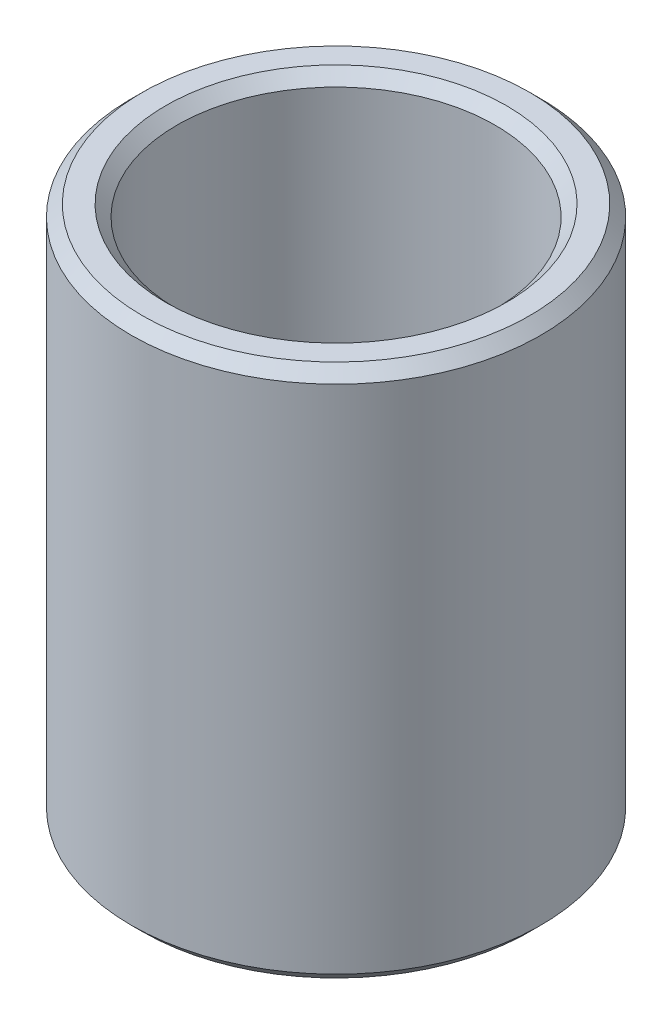
ISO-10303-21;
HEADER;
FILE_DESCRIPTION(('STEP AP214'),'2;1');
FILE_NAME('part.step','',(''),(''),'','','');
FILE_SCHEMA(('AUTOMOTIVE_DESIGN { 1 0 10303 214 1 1 1 1 }'));
ENDSEC;
DATA;
#1=APPLICATION_CONTEXT('core data for automotive mechanical design processes');
#2=APPLICATION_PROTOCOL_DEFINITION('international standard','automotive_design',2000,#1);
#3=PRODUCT_CONTEXT('',#1,'mechanical');
#4=PRODUCT('Part','Part','',(#3));
#5=PRODUCT_RELATED_PRODUCT_CATEGORY('part','',(#4));
#6=PRODUCT_DEFINITION_FORMATION('','',#4);
#7=PRODUCT_DEFINITION_CONTEXT('part definition',#1,'design');
#8=PRODUCT_DEFINITION('design','',#6,#7);
#9=PRODUCT_DEFINITION_SHAPE('','',#8);
#10=(LENGTH_UNIT() NAMED_UNIT(*) SI_UNIT(.MILLI.,.METRE.));
#11=(NAMED_UNIT(*) PLANE_ANGLE_UNIT() SI_UNIT($,.RADIAN.));
#12=(NAMED_UNIT(*) SI_UNIT($,.STERADIAN.) SOLID_ANGLE_UNIT());
#13=UNCERTAINTY_MEASURE_WITH_UNIT(LENGTH_MEASURE(1.E-05),#10,'distance_accuracy_value','');
#14=(GEOMETRIC_REPRESENTATION_CONTEXT(3) GLOBAL_UNCERTAINTY_ASSIGNED_CONTEXT((#13)) GLOBAL_UNIT_ASSIGNED_CONTEXT((#10,
#11,#12)) REPRESENTATION_CONTEXT('',''));
#15=CARTESIAN_POINT('',(0.,0.,0.));
#16=DIRECTION('',(0.,0.,1.));
#17=DIRECTION('',(1.,0.,0.));
#18=AXIS2_PLACEMENT_3D('',#15,#16,#17);
#19=CARTESIAN_POINT('',(0.,78.1369442736066,0.));
#20=DIRECTION('',(0.,-1.,0.));
#21=DIRECTION('',(0.,0.,-1.));
#22=AXIS2_PLACEMENT_3D('',#19,#20,#21);
#23=CYLINDRICAL_SURFACE('',#22,30.);
#24=CARTESIAN_POINT('',(0.,1.64889002076449,0.));
#25=DIRECTION('',(0.,1.,0.));
#26=DIRECTION('',(0.,0.,1.));
#27=AXIS2_PLACEMENT_3D('',#24,#25,#26);
#28=CIRCLE('',#27,30.);
#29=CARTESIAN_POINT('',(0.,1.64889002076449,30.));
#30=VERTEX_POINT('',#29);
#31=EDGE_CURVE('E10',#30,#30,#28,.T.);
#32=ORIENTED_EDGE('',*,*,#31,.T.);
#33=EDGE_LOOP('',(#32));
#34=FACE_BOUND('',#33,.T.);
#35=CARTESIAN_POINT('',(0.,76.488054252842,0.));
#36=DIRECTION('',(0.,1.,0.));
#37=DIRECTION('',(0.,0.,1.));
#38=AXIS2_PLACEMENT_3D('',#35,#36,#37);
#39=CIRCLE('',#38,30.);
#40=CARTESIAN_POINT('',(0.,76.488054252842,30.));
#41=VERTEX_POINT('',#40);
#42=EDGE_CURVE('E50',#41,#41,#39,.F.);
#43=ORIENTED_EDGE('',*,*,#42,.T.);
#44=EDGE_LOOP('',(#43));
#45=FACE_BOUND('',#44,.T.);
#46=ADVANCED_FACE('F39',(#34,#45),#23,.T.);
#47=CARTESIAN_POINT('',(0.,78.1369442736066,0.));
#48=DIRECTION('',(0.,1.,0.));
#49=DIRECTION('',(0.,0.,1.));
#50=AXIS2_PLACEMENT_3D('',#47,#48,#49);
#51=PLANE('',#50);
#52=CARTESIAN_POINT('',(0.,78.1369442736066,0.));
#53=DIRECTION('',(0.,1.,0.));
#54=DIRECTION('',(0.,0.,1.));
#55=AXIS2_PLACEMENT_3D('',#52,#53,#54);
#56=CIRCLE('',#55,24.9614116712223);
#57=CARTESIAN_POINT('',(0.,78.1369442736066,24.9614116712223));
#58=VERTEX_POINT('',#57);
#59=EDGE_CURVE('E58',#58,#58,#56,.F.);
#60=ORIENTED_EDGE('',*,*,#59,.T.);
#61=EDGE_LOOP('',(#60));
#62=FACE_BOUND('',#61,.T.);
#63=CARTESIAN_POINT('',(0.,78.1369442736066,0.));
#64=DIRECTION('',(0.,1.,0.));
#65=DIRECTION('',(0.,0.,1.));
#66=AXIS2_PLACEMENT_3D('',#63,#64,#65);
#67=CIRCLE('',#66,28.3511099792355);
#68=CARTESIAN_POINT('',(0.,78.1369442736066,28.3511099792355));
#69=VERTEX_POINT('',#68);
#70=EDGE_CURVE('E61',#69,#69,#67,.T.);
#71=ORIENTED_EDGE('',*,*,#70,.T.);
#72=EDGE_LOOP('',(#71));
#73=FACE_BOUND('',#72,.T.);
#74=ADVANCED_FACE('F88',(#62,#73),#51,.T.);
#75=CARTESIAN_POINT('',(0.,0.,0.));
#76=DIRECTION('',(0.,1.,0.));
#77=DIRECTION('',(0.,0.,1.));
#78=AXIS2_PLACEMENT_3D('',#75,#76,#77);
#79=PLANE('',#78);
#80=CARTESIAN_POINT('',(0.,0.,0.));
#81=DIRECTION('',(0.,1.,0.));
#82=DIRECTION('',(0.,0.,1.));
#83=AXIS2_PLACEMENT_3D('',#80,#81,#82);
#84=CIRCLE('',#83,24.9614116712223);
#85=CARTESIAN_POINT('',(0.,0.,24.9614116712223));
#86=VERTEX_POINT('',#85);
#87=EDGE_CURVE('E51',#86,#86,#84,.T.);
#88=ORIENTED_EDGE('',*,*,#87,.T.);
#89=EDGE_LOOP('',(#88));
#90=FACE_BOUND('',#89,.T.);
#91=CARTESIAN_POINT('',(0.,0.,0.));
#92=DIRECTION('',(0.,1.,0.));
#93=DIRECTION('',(0.,0.,1.));
#94=AXIS2_PLACEMENT_3D('',#91,#92,#93);
#95=CIRCLE('',#94,28.3511099792355);
#96=CARTESIAN_POINT('',(0.,0.,28.3511099792355));
#97=VERTEX_POINT('',#96);
#98=EDGE_CURVE('E54',#97,#97,#95,.F.);
#99=ORIENTED_EDGE('',*,*,#98,.T.);
#100=EDGE_LOOP('',(#99));
#101=FACE_BOUND('',#100,.T.);
#102=ADVANCED_FACE('F83',(#90,#101),#79,.F.);
#103=CARTESIAN_POINT('',(0.,78.1369442736066,0.));
#104=DIRECTION('',(0.,-1.,0.));
#105=DIRECTION('',(0.,0.,-1.));
#106=AXIS2_PLACEMENT_3D('',#103,#104,#105);
#107=CYLINDRICAL_SURFACE('',#106,23.3125216504578);
#108=CARTESIAN_POINT('',(0.,76.4880542528421,0.));
#109=DIRECTION('',(0.,1.,0.));
#110=DIRECTION('',(0.,0.,1.));
#111=AXIS2_PLACEMENT_3D('',#108,#109,#110);
#112=CIRCLE('',#111,23.3125216504578);
#113=CARTESIAN_POINT('',(0.,76.4880542528421,23.3125216504578));
#114=VERTEX_POINT('',#113);
#115=EDGE_CURVE('E67',#114,#114,#112,.T.);
#116=ORIENTED_EDGE('',*,*,#115,.T.);
#117=EDGE_LOOP('',(#116));
#118=FACE_BOUND('',#117,.T.);
#119=CARTESIAN_POINT('',(0.,1.64889002076452,0.));
#120=DIRECTION('',(0.,1.,0.));
#121=DIRECTION('',(0.,0.,1.));
#122=AXIS2_PLACEMENT_3D('',#119,#120,#121);
#123=CIRCLE('',#122,23.3125216504578);
#124=CARTESIAN_POINT('',(0.,1.64889002076452,23.3125216504578));
#125=VERTEX_POINT('',#124);
#126=EDGE_CURVE('E69',#125,#125,#123,.F.);
#127=ORIENTED_EDGE('',*,*,#126,.T.);
#128=EDGE_LOOP('',(#127));
#129=FACE_BOUND('',#128,.T.);
#130=ADVANCED_FACE('F71',(#118,#129),#107,.F.);
#131=CARTESIAN_POINT('',(0.,76.4880542528421,0.));
#132=DIRECTION('',(0.,1.,0.));
#133=DIRECTION('',(0.,0.,1.));
#134=AXIS2_PLACEMENT_3D('',#131,#132,#133);
#135=CONICAL_SURFACE('',#134,23.3125216504578,0.785398163397447);
#136=ORIENTED_EDGE('',*,*,#59,.F.);
#137=EDGE_LOOP('',(#136));
#138=FACE_BOUND('',#137,.T.);
#139=ORIENTED_EDGE('',*,*,#115,.F.);
#140=EDGE_LOOP('',(#139));
#141=FACE_BOUND('',#140,.T.);
#142=ADVANCED_FACE('F77',(#138,#141),#135,.F.);
#143=CARTESIAN_POINT('',(0.,0.,0.));
#144=DIRECTION('',(0.,-1.,0.));
#145=DIRECTION('',(0.,0.,-1.));
#146=AXIS2_PLACEMENT_3D('',#143,#144,#145);
#147=CONICAL_SURFACE('',#146,24.9614116712223,0.785398163397444);
#148=ORIENTED_EDGE('',*,*,#126,.F.);
#149=EDGE_LOOP('',(#148));
#150=FACE_BOUND('',#149,.T.);
#151=ORIENTED_EDGE('',*,*,#87,.F.);
#152=EDGE_LOOP('',(#151));
#153=FACE_BOUND('',#152,.T.);
#154=ADVANCED_FACE('F73',(#150,#153),#147,.F.);
#155=CARTESIAN_POINT('',(0.,1.64889002076449,0.));
#156=DIRECTION('',(0.,1.,0.));
#157=DIRECTION('',(0.,0.,1.));
#158=AXIS2_PLACEMENT_3D('',#155,#156,#157);
#159=CONICAL_SURFACE('',#158,30.,0.785398163397448);
#160=CARTESIAN_POINT('',(0.,0.,28.3511099792355));
#161=CARTESIAN_POINT('',(0.,0.0171759377162957,28.3682859169518));
#162=CARTESIAN_POINT('',(0.,0.0343518754325927,28.3854618546681));
#163=CARTESIAN_POINT('',(0.,0.0687037508651867,28.4198137301007));
#164=CARTESIAN_POINT('',(0.,0.0858796885814838,28.436989667817));
#165=CARTESIAN_POINT('',(0.,0.120231564014077,28.4713415432496));
#166=CARTESIAN_POINT('',(0.,0.137407501730374,28.4885174809659));
#167=CARTESIAN_POINT('',(0.,0.171759377162967,28.5228693563985));
#168=CARTESIAN_POINT('',(0.,0.188935314879264,28.5400452941148));
#169=CARTESIAN_POINT('',(0.,0.223287190311857,28.5743971695474));
#170=CARTESIAN_POINT('',(0.,0.240463128028154,28.5915731072637));
#171=CARTESIAN_POINT('',(0.,0.274815003460747,28.6259249826963));
#172=CARTESIAN_POINT('',(0.,0.291990941177045,28.6431009204126));
#173=CARTESIAN_POINT('',(0.,0.326342816609638,28.6774527958451));
#174=CARTESIAN_POINT('',(0.,0.343518754325935,28.6946287335614));
#175=CARTESIAN_POINT('',(0.,0.377870629758528,28.728980608994));
#176=CARTESIAN_POINT('',(0.,0.395046567474825,28.7461565467103));
#177=CARTESIAN_POINT('',(0.,0.429398442907418,28.7805084221429));
#178=CARTESIAN_POINT('',(0.,0.446574380623715,28.7976843598592));
#179=CARTESIAN_POINT('',(0.,0.480926256056308,28.8320362352918));
#180=CARTESIAN_POINT('',(0.,0.498102193772606,28.8492121730081));
#181=CARTESIAN_POINT('',(0.,0.532454069205199,28.8835640484407));
#182=CARTESIAN_POINT('',(0.,0.549630006921496,28.900739986157));
#183=CARTESIAN_POINT('',(0.,0.583981882354089,28.9350918615896));
#184=CARTESIAN_POINT('',(0.,0.601157820070386,28.9522677993059));
#185=CARTESIAN_POINT('',(0.,0.635509695502979,28.9866196747385));
#186=CARTESIAN_POINT('',(0.,0.652685633219276,29.0037956124548));
#187=CARTESIAN_POINT('',(0.,0.68703750865187,29.0381474878874));
#188=CARTESIAN_POINT('',(0.,0.704213446368167,29.0553234256037));
#189=CARTESIAN_POINT('',(0.,0.73856532180076,29.0896753010363));
#190=CARTESIAN_POINT('',(0.,0.755741259517057,29.1068512387526));
#191=CARTESIAN_POINT('',(0.,0.79009313494965,29.1412031141852));
#192=CARTESIAN_POINT('',(0.,0.807269072665947,29.1583790519015));
#193=CARTESIAN_POINT('',(0.,0.84162094809854,29.1927309273341));
#194=CARTESIAN_POINT('',(0.,0.858796885814837,29.2099068650503));
#195=CARTESIAN_POINT('',(0.,0.89314876124743,29.2442587404829));
#196=CARTESIAN_POINT('',(0.,0.910324698963727,29.2614346781992));
#197=CARTESIAN_POINT('',(0.,0.944676574396321,29.2957865536318));
#198=CARTESIAN_POINT('',(0.,0.961852512112618,29.3129624913481));
#199=CARTESIAN_POINT('',(0.,0.996204387545211,29.3473143667807));
#200=CARTESIAN_POINT('',(0.,1.01338032526151,29.364490304497));
#201=CARTESIAN_POINT('',(0.,1.0477322006941,29.3988421799296));
#202=CARTESIAN_POINT('',(0.,1.0649081384104,29.4160181176459));
#203=CARTESIAN_POINT('',(0.,1.09926001384299,29.4503699930785));
#204=CARTESIAN_POINT('',(0.,1.11643595155929,29.4675459307948));
#205=CARTESIAN_POINT('',(0.,1.15078782699188,29.5018978062274));
#206=CARTESIAN_POINT('',(0.,1.16796376470818,29.5190737439437));
#207=CARTESIAN_POINT('',(0.,1.20231564014077,29.5534256193763));
#208=CARTESIAN_POINT('',(0.,1.21949157785707,29.5706015570926));
#209=CARTESIAN_POINT('',(0.,1.25384345328966,29.6049534325252));
#210=CARTESIAN_POINT('',(0.,1.27101939100596,29.6221293702415));
#211=CARTESIAN_POINT('',(0.,1.30537126643855,29.6564812456741));
#212=CARTESIAN_POINT('',(0.,1.32254720415485,29.6736571833904));
#213=CARTESIAN_POINT('',(0.,1.35689907958744,29.708009058823));
#214=CARTESIAN_POINT('',(0.,1.37407501730374,29.7251849965393));
#215=CARTESIAN_POINT('',(0.,1.40842689273633,29.7595368719718));
#216=CARTESIAN_POINT('',(0.,1.42560283045263,29.7767128096881));
#217=CARTESIAN_POINT('',(0.,1.45995470588522,29.8110646851207));
#218=CARTESIAN_POINT('',(0.,1.47713064360152,29.828240622837));
#219=CARTESIAN_POINT('',(0.,1.51148251903411,29.8625924982696));
#220=CARTESIAN_POINT('',(0.,1.52865845675041,29.8797684359859));
#221=CARTESIAN_POINT('',(0.,1.563010332183,29.9141203114185));
#222=CARTESIAN_POINT('',(0.,1.5801862698993,29.9312962491348));
#223=CARTESIAN_POINT('',(0.,1.61453814533189,29.9656481245674));
#224=CARTESIAN_POINT('',(0.,1.63171408304819,29.9828240622837));
#225=CARTESIAN_POINT('',(0.,1.64889002076449,30.));
#226=B_SPLINE_CURVE_WITH_KNOTS('',3,(#160,#161,#162,#163,#164,#165,#166,#167,#168,#169,#170,
#171,#172,#173,#174,#175,#176,#177,#178,#179,#180,#181,#182,#183,#184,#185,#186,#187,#188,#189,
#190,#191,#192,#193,#194,#195,#196,#197,#198,#199,#200,#201,#202,#203,#204,#205,#206,#207,#208,
#209,#210,#211,#212,#213,#214,#215,#216,#217,#218,#219,#220,#221,#222,#223,#224,#225),
.UNSPECIFIED.,.F.,.F.,(4,2,2,2,2,2,2,2,2,2,2,2,2,2,2,2,2,2,2,2,2,2,2,2,2,2,2,2,2,2,2,2,4),(0.,
0.0728713321945879,0.145742664389173,0.218613996583761,0.291485328778349,0.364356660972937,
0.437227993167522,0.51009932536211,0.582970657556698,0.655841989751286,0.728713321945871,
0.801584654140459,0.874455986335047,0.947327318529635,1.02019865072422,1.09306998291881,
1.1659413151134,1.23881264730798,1.31168397950257,1.38455531169716,1.45742664389174,
1.53029797608633,1.60316930828092,1.67604064047551,1.74891197267009,1.82178330486468,
1.89465463705927,1.96752596925386,2.04039730144844,2.11326863364303,2.18613996583762,
2.2590112980322,2.33188263022679),.UNSPECIFIED.);
#227=EDGE_CURVE('BSEAM76',#97,#30,#226,.T.);
#228=ORIENTED_EDGE('',*,*,#98,.F.);
#229=ORIENTED_EDGE('',*,*,#31,.F.);
#230=ORIENTED_EDGE('',*,*,#227,.T.);
#231=ORIENTED_EDGE('',*,*,#227,.F.);
#232=EDGE_LOOP('',(#228,#230,#229,#231));
#233=FACE_BOUND('',#232,.T.);
#234=ADVANCED_FACE('F76',(#233),#159,.T.);
#235=CARTESIAN_POINT('',(0.,78.1369442736066,0.));
#236=DIRECTION('',(0.,-1.,0.));
#237=DIRECTION('',(0.,0.,-1.));
#238=AXIS2_PLACEMENT_3D('',#235,#236,#237);
#239=CONICAL_SURFACE('',#238,28.3511099792355,0.785398163397444);
#240=ORIENTED_EDGE('',*,*,#42,.F.);
#241=EDGE_LOOP('',(#240));
#242=FACE_BOUND('',#241,.T.);
#243=ORIENTED_EDGE('',*,*,#70,.F.);
#244=EDGE_LOOP('',(#243));
#245=FACE_BOUND('',#244,.T.);
#246=ADVANCED_FACE('F45',(#242,#245),#239,.T.);
#247=CLOSED_SHELL('',(#46,#74,#102,#130,#142,#154,#234,#246));
#248=MANIFOLD_SOLID_BREP('B2',#247);
#249=ADVANCED_BREP_SHAPE_REPRESENTATION('',(#18,#248),#14);
#250=SHAPE_DEFINITION_REPRESENTATION(#9,#249);
ENDSEC;
END-ISO-10303-21;
